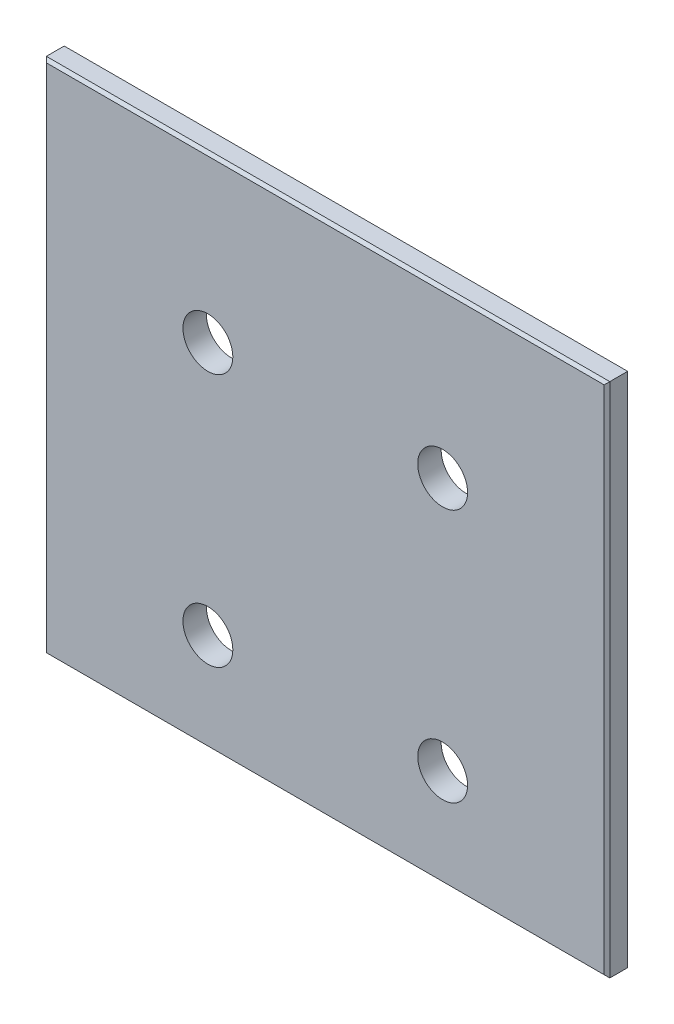
ISO-10303-21;
HEADER;
FILE_DESCRIPTION(('STEP AP214'),'2;1');
FILE_NAME('part.step','',(''),(''),'','','');
FILE_SCHEMA(('AUTOMOTIVE_DESIGN { 1 0 10303 214 1 1 1 1 }'));
ENDSEC;
DATA;
#1=APPLICATION_CONTEXT('core data for automotive mechanical design processes');
#2=APPLICATION_PROTOCOL_DEFINITION('international standard','automotive_design',2000,#1);
#3=PRODUCT_CONTEXT('',#1,'mechanical');
#4=PRODUCT('Part','Part','',(#3));
#5=PRODUCT_RELATED_PRODUCT_CATEGORY('part','',(#4));
#6=PRODUCT_DEFINITION_FORMATION('','',#4);
#7=PRODUCT_DEFINITION_CONTEXT('part definition',#1,'design');
#8=PRODUCT_DEFINITION('design','',#6,#7);
#9=PRODUCT_DEFINITION_SHAPE('','',#8);
#10=(LENGTH_UNIT() NAMED_UNIT(*) SI_UNIT(.MILLI.,.METRE.));
#11=(NAMED_UNIT(*) PLANE_ANGLE_UNIT() SI_UNIT($,.RADIAN.));
#12=(NAMED_UNIT(*) SI_UNIT($,.STERADIAN.) SOLID_ANGLE_UNIT());
#13=UNCERTAINTY_MEASURE_WITH_UNIT(LENGTH_MEASURE(1.E-05),#10,'distance_accuracy_value','');
#14=(GEOMETRIC_REPRESENTATION_CONTEXT(3) GLOBAL_UNCERTAINTY_ASSIGNED_CONTEXT((#13)) GLOBAL_UNIT_ASSIGNED_CONTEXT((#10,
#11,#12)) REPRESENTATION_CONTEXT('',''));
#15=CARTESIAN_POINT('',(0.,0.,0.));
#16=DIRECTION('',(0.,0.,1.));
#17=DIRECTION('',(1.,0.,0.));
#18=AXIS2_PLACEMENT_3D('',#15,#16,#17);
#19=CARTESIAN_POINT('',(-76.2,69.85,6.35));
#20=DIRECTION('',(1.,0.,0.));
#21=DIRECTION('',(0.,1.,0.));
#22=AXIS2_PLACEMENT_3D('',#19,#20,#21);
#23=PLANE('',#22);
#24=DIRECTION('',(0.,0.,-1.));
#25=VECTOR('',#24,1.);
#26=CARTESIAN_POINT('',(-76.2,69.85,6.35));
#27=LINE('',#26,#25);
#28=CARTESIAN_POINT('',(-76.2,69.85,5.58799999999999));
#29=VERTEX_POINT('',#28);
#30=CARTESIAN_POINT('',(-76.2,69.85,0.761999999999999));
#31=VERTEX_POINT('',#30);
#32=EDGE_CURVE('E170',#29,#31,#27,.T.);
#33=ORIENTED_EDGE('',*,*,#32,.T.);
#34=DIRECTION('',(0.,-1.,0.));
#35=VECTOR('',#34,1.);
#36=CARTESIAN_POINT('',(-76.2,69.85,0.761999999999999));
#37=LINE('',#36,#35);
#38=CARTESIAN_POINT('',(-76.2,-69.85,0.761999999999999));
#39=VERTEX_POINT('',#38);
#40=EDGE_CURVE('E195',#31,#39,#37,.T.);
#41=ORIENTED_EDGE('',*,*,#40,.T.);
#42=DIRECTION('',(0.,0.,-1.));
#43=VECTOR('',#42,1.);
#44=CARTESIAN_POINT('',(-76.2,-69.85,6.35));
#45=LINE('',#44,#43);
#46=CARTESIAN_POINT('',(-76.2,-69.85,5.58799999999999));
#47=VERTEX_POINT('',#46);
#48=EDGE_CURVE('E133',#47,#39,#45,.T.);
#49=ORIENTED_EDGE('',*,*,#48,.F.);
#50=DIRECTION('',(0.,1.,0.));
#51=VECTOR('',#50,1.);
#52=CARTESIAN_POINT('',(-76.2,69.85,5.58799999999999));
#53=LINE('',#52,#51);
#54=EDGE_CURVE('E193',#47,#29,#53,.T.);
#55=ORIENTED_EDGE('',*,*,#54,.T.);
#56=EDGE_LOOP('',(#33,#41,#49,#55));
#57=FACE_BOUND('',#56,.T.);
#58=ADVANCED_FACE('F44',(#57),#23,.F.);
#59=CARTESIAN_POINT('',(-76.2,-69.85,6.35));
#60=DIRECTION('',(0.,1.,0.));
#61=DIRECTION('',(0.,0.,1.));
#62=AXIS2_PLACEMENT_3D('',#59,#60,#61);
#63=PLANE('',#62);
#64=ORIENTED_EDGE('',*,*,#48,.T.);
#65=DIRECTION('',(1.,0.,0.));
#66=VECTOR('',#65,1.);
#67=CARTESIAN_POINT('',(-76.2,-69.85,0.761999999999999));
#68=LINE('',#67,#66);
#69=CARTESIAN_POINT('',(76.2,-69.85,0.761999999999999));
#70=VERTEX_POINT('',#69);
#71=EDGE_CURVE('E132',#39,#70,#68,.T.);
#72=ORIENTED_EDGE('',*,*,#71,.T.);
#73=DIRECTION('',(0.,0.,-1.));
#74=VECTOR('',#73,1.);
#75=CARTESIAN_POINT('',(76.2,-69.85,6.35));
#76=LINE('',#75,#74);
#77=CARTESIAN_POINT('',(76.2,-69.85,5.58799999999999));
#78=VERTEX_POINT('',#77);
#79=EDGE_CURVE('E115',#78,#70,#76,.T.);
#80=ORIENTED_EDGE('',*,*,#79,.F.);
#81=DIRECTION('',(-1.,0.,0.));
#82=VECTOR('',#81,1.);
#83=CARTESIAN_POINT('',(-76.2,-69.85,5.58799999999999));
#84=LINE('',#83,#82);
#85=EDGE_CURVE('E129',#78,#47,#84,.T.);
#86=ORIENTED_EDGE('',*,*,#85,.T.);
#87=EDGE_LOOP('',(#64,#72,#80,#86));
#88=FACE_BOUND('',#87,.T.);
#89=ADVANCED_FACE('F128',(#88),#63,.F.);
#90=CARTESIAN_POINT('',(76.2,69.85,6.35));
#91=DIRECTION('',(-1.,0.,0.));
#92=DIRECTION('',(0.,0.,1.));
#93=AXIS2_PLACEMENT_3D('',#90,#91,#92);
#94=PLANE('',#93);
#95=ORIENTED_EDGE('',*,*,#79,.T.);
#96=DIRECTION('',(0.,1.,0.));
#97=VECTOR('',#96,1.);
#98=CARTESIAN_POINT('',(76.2,69.85,0.761999999999999));
#99=LINE('',#98,#97);
#100=CARTESIAN_POINT('',(76.2,69.85,0.761999999999999));
#101=VERTEX_POINT('',#100);
#102=EDGE_CURVE('E121',#70,#101,#99,.T.);
#103=ORIENTED_EDGE('',*,*,#102,.T.);
#104=DIRECTION('',(0.,0.,-1.));
#105=VECTOR('',#104,1.);
#106=CARTESIAN_POINT('',(76.2,69.85,6.35));
#107=LINE('',#106,#105);
#108=CARTESIAN_POINT('',(76.2,69.85,5.58799999999999));
#109=VERTEX_POINT('',#108);
#110=EDGE_CURVE('E117',#109,#101,#107,.T.);
#111=ORIENTED_EDGE('',*,*,#110,.F.);
#112=DIRECTION('',(0.,-1.,0.));
#113=VECTOR('',#112,1.);
#114=CARTESIAN_POINT('',(76.2,-69.85,5.58799999999999));
#115=LINE('',#114,#113);
#116=EDGE_CURVE('E112',#109,#78,#115,.T.);
#117=ORIENTED_EDGE('',*,*,#116,.T.);
#118=EDGE_LOOP('',(#95,#103,#111,#117));
#119=FACE_BOUND('',#118,.T.);
#120=ADVANCED_FACE('F114',(#119),#94,.F.);
#121=CARTESIAN_POINT('',(-76.2,69.85,6.35));
#122=DIRECTION('',(0.,-1.,0.));
#123=DIRECTION('',(0.,0.,-1.));
#124=AXIS2_PLACEMENT_3D('',#121,#122,#123);
#125=PLANE('',#124);
#126=ORIENTED_EDGE('',*,*,#110,.T.);
#127=DIRECTION('',(-1.,0.,0.));
#128=VECTOR('',#127,1.);
#129=CARTESIAN_POINT('',(-76.2,69.85,0.761999999999999));
#130=LINE('',#129,#128);
#131=EDGE_CURVE('E122',#101,#31,#130,.T.);
#132=ORIENTED_EDGE('',*,*,#131,.T.);
#133=ORIENTED_EDGE('',*,*,#32,.F.);
#134=DIRECTION('',(1.,0.,0.));
#135=VECTOR('',#134,1.);
#136=CARTESIAN_POINT('',(76.2,69.85,5.58799999999999));
#137=LINE('',#136,#135);
#138=EDGE_CURVE('E197',#29,#109,#137,.T.);
#139=ORIENTED_EDGE('',*,*,#138,.T.);
#140=EDGE_LOOP('',(#126,#132,#133,#139));
#141=FACE_BOUND('',#140,.T.);
#142=ADVANCED_FACE('F209',(#141),#125,.F.);
#143=CARTESIAN_POINT('',(-76.2,-69.85,6.35));
#144=DIRECTION('',(0.,0.,1.));
#145=DIRECTION('',(1.,0.,0.));
#146=AXIS2_PLACEMENT_3D('',#143,#144,#145);
#147=PLANE('',#146);
#148=CARTESIAN_POINT('',(-31.75,25.4,6.35));
#149=DIRECTION('',(0.,0.,1.));
#150=DIRECTION('',(1.,0.,0.));
#151=AXIS2_PLACEMENT_3D('',#148,#149,#150);
#152=CIRCLE('',#151,6.74623999999999);
#153=CARTESIAN_POINT('',(-25.00376,25.4,6.35));
#154=VERTEX_POINT('',#153);
#155=EDGE_CURVE('E266',#154,#154,#152,.T.);
#156=ORIENTED_EDGE('',*,*,#155,.F.);
#157=EDGE_LOOP('',(#156));
#158=FACE_BOUND('',#157,.T.);
#159=CARTESIAN_POINT('',(31.75,25.4,6.35));
#160=DIRECTION('',(0.,0.,1.));
#161=DIRECTION('',(1.,0.,0.));
#162=AXIS2_PLACEMENT_3D('',#159,#160,#161);
#163=CIRCLE('',#162,6.74623999999999);
#164=CARTESIAN_POINT('',(38.49624,25.4,6.35));
#165=VERTEX_POINT('',#164);
#166=EDGE_CURVE('E268',#165,#165,#163,.T.);
#167=ORIENTED_EDGE('',*,*,#166,.F.);
#168=EDGE_LOOP('',(#167));
#169=FACE_BOUND('',#168,.T.);
#170=CARTESIAN_POINT('',(-31.75,-43.18,6.35));
#171=DIRECTION('',(0.,0.,1.));
#172=DIRECTION('',(1.,0.,0.));
#173=AXIS2_PLACEMENT_3D('',#170,#171,#172);
#174=CIRCLE('',#173,6.74623999999999);
#175=CARTESIAN_POINT('',(-25.00376,-43.18,6.35));
#176=VERTEX_POINT('',#175);
#177=EDGE_CURVE('E276',#176,#176,#174,.T.);
#178=ORIENTED_EDGE('',*,*,#177,.F.);
#179=EDGE_LOOP('',(#178));
#180=FACE_BOUND('',#179,.T.);
#181=CARTESIAN_POINT('',(31.75,-43.18,6.35));
#182=DIRECTION('',(0.,0.,1.));
#183=DIRECTION('',(1.,0.,0.));
#184=AXIS2_PLACEMENT_3D('',#181,#182,#183);
#185=CIRCLE('',#184,6.74623999999999);
#186=CARTESIAN_POINT('',(38.49624,-43.18,6.35));
#187=VERTEX_POINT('',#186);
#188=EDGE_CURVE('E146',#187,#187,#185,.T.);
#189=ORIENTED_EDGE('',*,*,#188,.F.);
#190=EDGE_LOOP('',(#189));
#191=FACE_BOUND('',#190,.T.);
#192=DIRECTION('',(0.,-1.,0.));
#193=VECTOR('',#192,1.);
#194=CARTESIAN_POINT('',(-75.438,-69.85,6.35));
#195=LINE('',#194,#193);
#196=CARTESIAN_POINT('',(-75.438,69.088,6.35));
#197=VERTEX_POINT('',#196);
#198=CARTESIAN_POINT('',(-75.438,-69.088,6.35));
#199=VERTEX_POINT('',#198);
#200=EDGE_CURVE('E201',#197,#199,#195,.T.);
#201=ORIENTED_EDGE('',*,*,#200,.T.);
#202=DIRECTION('',(1.,0.,0.));
#203=VECTOR('',#202,1.);
#204=CARTESIAN_POINT('',(76.2,-69.088,6.35));
#205=LINE('',#204,#203);
#206=CARTESIAN_POINT('',(75.438,-69.088,6.35));
#207=VERTEX_POINT('',#206);
#208=EDGE_CURVE('E13',#199,#207,#205,.T.);
#209=ORIENTED_EDGE('',*,*,#208,.T.);
#210=DIRECTION('',(0.,1.,0.));
#211=VECTOR('',#210,1.);
#212=CARTESIAN_POINT('',(75.438,69.85,6.35));
#213=LINE('',#212,#211);
#214=CARTESIAN_POINT('',(75.438,69.088,6.35));
#215=VERTEX_POINT('',#214);
#216=EDGE_CURVE('E53',#207,#215,#213,.T.);
#217=ORIENTED_EDGE('',*,*,#216,.T.);
#218=DIRECTION('',(-1.,0.,0.));
#219=VECTOR('',#218,1.);
#220=CARTESIAN_POINT('',(-76.2,69.088,6.35));
#221=LINE('',#220,#219);
#222=EDGE_CURVE('E203',#215,#197,#221,.T.);
#223=ORIENTED_EDGE('',*,*,#222,.T.);
#224=EDGE_LOOP('',(#201,#209,#217,#223));
#225=FACE_BOUND('',#224,.T.);
#226=ADVANCED_FACE('F204',(#158,#169,#180,#191,#225),#147,.T.);
#227=CARTESIAN_POINT('',(-76.2,-69.85,0.));
#228=DIRECTION('',(0.,0.,1.));
#229=DIRECTION('',(1.,0.,0.));
#230=AXIS2_PLACEMENT_3D('',#227,#228,#229);
#231=PLANE('',#230);
#232=CARTESIAN_POINT('',(-31.75,25.4,0.));
#233=DIRECTION('',(0.,0.,1.));
#234=DIRECTION('',(1.,0.,0.));
#235=AXIS2_PLACEMENT_3D('',#232,#233,#234);
#236=CIRCLE('',#235,6.74623999999999);
#237=CARTESIAN_POINT('',(-25.00376,25.4,0.));
#238=VERTEX_POINT('',#237);
#239=EDGE_CURVE('E263',#238,#238,#236,.T.);
#240=ORIENTED_EDGE('',*,*,#239,.T.);
#241=EDGE_LOOP('',(#240));
#242=FACE_BOUND('',#241,.T.);
#243=CARTESIAN_POINT('',(31.75,25.4,0.));
#244=DIRECTION('',(0.,0.,1.));
#245=DIRECTION('',(1.,0.,0.));
#246=AXIS2_PLACEMENT_3D('',#243,#244,#245);
#247=CIRCLE('',#246,6.74623999999999);
#248=CARTESIAN_POINT('',(38.49624,25.4,0.));
#249=VERTEX_POINT('',#248);
#250=EDGE_CURVE('E273',#249,#249,#247,.T.);
#251=ORIENTED_EDGE('',*,*,#250,.T.);
#252=EDGE_LOOP('',(#251));
#253=FACE_BOUND('',#252,.T.);
#254=CARTESIAN_POINT('',(-31.75,-43.18,0.));
#255=DIRECTION('',(0.,0.,1.));
#256=DIRECTION('',(1.,0.,0.));
#257=AXIS2_PLACEMENT_3D('',#254,#255,#256);
#258=CIRCLE('',#257,6.74623999999999);
#259=CARTESIAN_POINT('',(-25.00376,-43.18,0.));
#260=VERTEX_POINT('',#259);
#261=EDGE_CURVE('E279',#260,#260,#258,.T.);
#262=ORIENTED_EDGE('',*,*,#261,.T.);
#263=EDGE_LOOP('',(#262));
#264=FACE_BOUND('',#263,.T.);
#265=CARTESIAN_POINT('',(31.75,-43.18,0.));
#266=DIRECTION('',(0.,0.,1.));
#267=DIRECTION('',(1.,0.,0.));
#268=AXIS2_PLACEMENT_3D('',#265,#266,#267);
#269=CIRCLE('',#268,6.74623999999999);
#270=CARTESIAN_POINT('',(38.49624,-43.18,0.));
#271=VERTEX_POINT('',#270);
#272=EDGE_CURVE('E141',#271,#271,#269,.T.);
#273=ORIENTED_EDGE('',*,*,#272,.T.);
#274=EDGE_LOOP('',(#273));
#275=FACE_BOUND('',#274,.T.);
#276=DIRECTION('',(0.,-1.,0.));
#277=VECTOR('',#276,1.);
#278=CARTESIAN_POINT('',(75.438,-69.85,0.));
#279=LINE('',#278,#277);
#280=CARTESIAN_POINT('',(75.438,69.088,0.));
#281=VERTEX_POINT('',#280);
#282=CARTESIAN_POINT('',(75.438,-69.088,0.));
#283=VERTEX_POINT('',#282);
#284=EDGE_CURVE('E184',#281,#283,#279,.T.);
#285=ORIENTED_EDGE('',*,*,#284,.T.);
#286=DIRECTION('',(-1.,0.,0.));
#287=VECTOR('',#286,1.);
#288=CARTESIAN_POINT('',(-76.2,-69.088,0.));
#289=LINE('',#288,#287);
#290=CARTESIAN_POINT('',(-75.438,-69.088,0.));
#291=VERTEX_POINT('',#290);
#292=EDGE_CURVE('E190',#283,#291,#289,.T.);
#293=ORIENTED_EDGE('',*,*,#292,.T.);
#294=DIRECTION('',(0.,1.,0.));
#295=VECTOR('',#294,1.);
#296=CARTESIAN_POINT('',(-75.438,-69.85,0.));
#297=LINE('',#296,#295);
#298=CARTESIAN_POINT('',(-75.438,69.088,0.));
#299=VERTEX_POINT('',#298);
#300=EDGE_CURVE('E188',#291,#299,#297,.T.);
#301=ORIENTED_EDGE('',*,*,#300,.T.);
#302=DIRECTION('',(1.,0.,0.));
#303=VECTOR('',#302,1.);
#304=CARTESIAN_POINT('',(-76.2,69.088,0.));
#305=LINE('',#304,#303);
#306=EDGE_CURVE('E186',#299,#281,#305,.T.);
#307=ORIENTED_EDGE('',*,*,#306,.T.);
#308=EDGE_LOOP('',(#285,#293,#301,#307));
#309=FACE_BOUND('',#308,.T.);
#310=ADVANCED_FACE('F236',(#242,#253,#264,#275,#309),#231,.F.);
#311=CARTESIAN_POINT('',(-76.2,69.85,0.761999999999999));
#312=DIRECTION('',(0.,-0.707106781186554,0.707106781186541));
#313=DIRECTION('',(0.,-0.707106781186541,-0.707106781186554));
#314=AXIS2_PLACEMENT_3D('',#311,#312,#313);
#315=PLANE('',#314);
#316=DIRECTION('',(0.577350269189636,0.577350269189615,0.577350269189626));
#317=VECTOR('',#316,1.);
#318=CARTESIAN_POINT('',(76.2,69.85,0.761999999999999));
#319=LINE('',#318,#317);
#320=EDGE_CURVE('E162',#281,#101,#319,.T.);
#321=ORIENTED_EDGE('',*,*,#320,.F.);
#322=ORIENTED_EDGE('',*,*,#306,.F.);
#323=DIRECTION('',(-0.577350269189629,0.577350269189619,0.577350269189629));
#324=VECTOR('',#323,1.);
#325=CARTESIAN_POINT('',(-76.2,69.85,0.761999999999999));
#326=LINE('',#325,#324);
#327=EDGE_CURVE('E149',#31,#299,#326,.F.);
#328=ORIENTED_EDGE('',*,*,#327,.F.);
#329=ORIENTED_EDGE('',*,*,#131,.F.);
#330=EDGE_LOOP('',(#321,#322,#328,#329));
#331=FACE_BOUND('',#330,.T.);
#332=ADVANCED_FACE('F212',(#331),#315,.F.);
#333=CARTESIAN_POINT('',(-76.2,69.85,0.761999999999999));
#334=DIRECTION('',(0.707106781186548,0.,0.707106781186548));
#335=DIRECTION('',(0.707106781186548,0.,-0.707106781186548));
#336=AXIS2_PLACEMENT_3D('',#333,#334,#335);
#337=PLANE('',#336);
#338=ORIENTED_EDGE('',*,*,#327,.T.);
#339=ORIENTED_EDGE('',*,*,#300,.F.);
#340=DIRECTION('',(-0.577350269189626,-0.577350269189626,0.577350269189626));
#341=VECTOR('',#340,1.);
#342=CARTESIAN_POINT('',(-29.6333333333333,-23.2833333333333,-45.8046666666667));
#343=LINE('',#342,#341);
#344=EDGE_CURVE('E156',#39,#291,#343,.F.);
#345=ORIENTED_EDGE('',*,*,#344,.F.);
#346=ORIENTED_EDGE('',*,*,#40,.F.);
#347=EDGE_LOOP('',(#338,#339,#345,#346));
#348=FACE_BOUND('',#347,.T.);
#349=ADVANCED_FACE('F215',(#348),#337,.F.);
#350=CARTESIAN_POINT('',(76.2,69.85,0.761999999999999));
#351=DIRECTION('',(-0.707106781186541,0.,0.707106781186554));
#352=DIRECTION('',(0.707106781186554,0.,0.707106781186541));
#353=AXIS2_PLACEMENT_3D('',#350,#351,#352);
#354=PLANE('',#353);
#355=ORIENTED_EDGE('',*,*,#320,.T.);
#356=ORIENTED_EDGE('',*,*,#102,.F.);
#357=DIRECTION('',(-0.577350269189633,0.577350269189622,-0.577350269189622));
#358=VECTOR('',#357,1.);
#359=CARTESIAN_POINT('',(29.6333333333331,-23.2833333333339,-45.8046666666661));
#360=LINE('',#359,#358);
#361=EDGE_CURVE('E152',#283,#70,#360,.F.);
#362=ORIENTED_EDGE('',*,*,#361,.F.);
#363=ORIENTED_EDGE('',*,*,#284,.F.);
#364=EDGE_LOOP('',(#355,#356,#362,#363));
#365=FACE_BOUND('',#364,.T.);
#366=ADVANCED_FACE('F218',(#365),#354,.F.);
#367=CARTESIAN_POINT('',(-76.2,-69.85,0.761999999999999));
#368=DIRECTION('',(0.,0.707106781186548,0.707106781186548));
#369=DIRECTION('',(0.,-0.707106781186548,0.707106781186548));
#370=AXIS2_PLACEMENT_3D('',#367,#368,#369);
#371=PLANE('',#370);
#372=ORIENTED_EDGE('',*,*,#344,.T.);
#373=ORIENTED_EDGE('',*,*,#292,.F.);
#374=ORIENTED_EDGE('',*,*,#361,.T.);
#375=ORIENTED_EDGE('',*,*,#71,.F.);
#376=EDGE_LOOP('',(#372,#373,#374,#375));
#377=FACE_BOUND('',#376,.T.);
#378=ADVANCED_FACE('F216',(#377),#371,.F.);
#379=CARTESIAN_POINT('',(-76.2,69.088,6.35));
#380=DIRECTION('',(0.,0.707106781186558,0.707106781186537));
#381=DIRECTION('',(0.,-0.707106781186537,0.707106781186558));
#382=AXIS2_PLACEMENT_3D('',#379,#380,#381);
#383=PLANE('',#382);
#384=DIRECTION('',(0.577350269189634,0.577350269189613,-0.57735026918963));
#385=VECTOR('',#384,1.);
#386=CARTESIAN_POINT('',(24.8919999999985,18.5420000000003,56.8960000000011));
#387=LINE('',#386,#385);
#388=EDGE_CURVE('E143',#109,#215,#387,.F.);
#389=ORIENTED_EDGE('',*,*,#388,.F.);
#390=ORIENTED_EDGE('',*,*,#138,.F.);
#391=DIRECTION('',(-0.577350269189627,0.577350269189617,-0.577350269189633));
#392=VECTOR('',#391,1.);
#393=CARTESIAN_POINT('',(-29.1253333333339,22.7753333333348,52.6626666666666));
#394=LINE('',#393,#392);
#395=EDGE_CURVE('E48',#197,#29,#394,.T.);
#396=ORIENTED_EDGE('',*,*,#395,.F.);
#397=ORIENTED_EDGE('',*,*,#222,.F.);
#398=EDGE_LOOP('',(#389,#390,#396,#397));
#399=FACE_BOUND('',#398,.T.);
#400=ADVANCED_FACE('F46',(#399),#383,.T.);
#401=CARTESIAN_POINT('',(-75.438,-69.85,6.35));
#402=DIRECTION('',(-0.707106781186551,0.,0.707106781186544));
#403=DIRECTION('',(0.707106781186544,0.,0.707106781186551));
#404=AXIS2_PLACEMENT_3D('',#401,#402,#403);
#405=PLANE('',#404);
#406=ORIENTED_EDGE('',*,*,#395,.T.);
#407=ORIENTED_EDGE('',*,*,#54,.F.);
#408=DIRECTION('',(0.577350269189624,0.577350269189624,0.57735026918963));
#409=VECTOR('',#408,1.);
#410=CARTESIAN_POINT('',(-75.692,-69.342,6.096));
#411=LINE('',#410,#409);
#412=EDGE_CURVE('E137',#199,#47,#411,.F.);
#413=ORIENTED_EDGE('',*,*,#412,.F.);
#414=ORIENTED_EDGE('',*,*,#200,.F.);
#415=EDGE_LOOP('',(#406,#407,#413,#414));
#416=FACE_BOUND('',#415,.T.);
#417=ADVANCED_FACE('F207',(#416),#405,.T.);
#418=CARTESIAN_POINT('',(75.438,-69.85,6.35));
#419=DIRECTION('',(0.707106781186545,0.,0.70710678118655));
#420=DIRECTION('',(0.70710678118655,0.,-0.707106781186545));
#421=AXIS2_PLACEMENT_3D('',#418,#419,#420);
#422=PLANE('',#421);
#423=ORIENTED_EDGE('',*,*,#388,.T.);
#424=ORIENTED_EDGE('',*,*,#216,.F.);
#425=DIRECTION('',(0.577350269189631,-0.57735026918962,-0.577350269189626));
#426=VECTOR('',#425,1.);
#427=CARTESIAN_POINT('',(75.692,-69.342,6.096));
#428=LINE('',#427,#426);
#429=EDGE_CURVE('E61',#78,#207,#428,.F.);
#430=ORIENTED_EDGE('',*,*,#429,.F.);
#431=ORIENTED_EDGE('',*,*,#116,.F.);
#432=EDGE_LOOP('',(#423,#424,#430,#431));
#433=FACE_BOUND('',#432,.T.);
#434=ADVANCED_FACE('F140',(#433),#422,.T.);
#435=CARTESIAN_POINT('',(-76.2,-69.088,6.35));
#436=DIRECTION('',(0.,-0.707106781186551,0.707106781186544));
#437=DIRECTION('',(0.,-0.707106781186544,-0.707106781186551));
#438=AXIS2_PLACEMENT_3D('',#435,#436,#437);
#439=PLANE('',#438);
#440=ORIENTED_EDGE('',*,*,#412,.T.);
#441=ORIENTED_EDGE('',*,*,#85,.F.);
#442=ORIENTED_EDGE('',*,*,#429,.T.);
#443=ORIENTED_EDGE('',*,*,#208,.F.);
#444=EDGE_LOOP('',(#440,#441,#442,#443));
#445=FACE_BOUND('',#444,.T.);
#446=ADVANCED_FACE('F135',(#445),#439,.T.);
#447=CARTESIAN_POINT('',(31.75,-43.18,6.35));
#448=DIRECTION('',(0.,0.,1.));
#449=DIRECTION('',(1.,0.,0.));
#450=AXIS2_PLACEMENT_3D('',#447,#448,#449);
#451=CYLINDRICAL_SURFACE('',#450,6.74623999999999);
#452=ORIENTED_EDGE('',*,*,#272,.F.);
#453=EDGE_LOOP('',(#452));
#454=FACE_BOUND('',#453,.T.);
#455=ORIENTED_EDGE('',*,*,#188,.T.);
#456=EDGE_LOOP('',(#455));
#457=FACE_BOUND('',#456,.T.);
#458=ADVANCED_FACE('F243',(#454,#457),#451,.F.);
#459=CARTESIAN_POINT('',(-31.75,-43.18,6.35));
#460=DIRECTION('',(0.,0.,1.));
#461=DIRECTION('',(1.,0.,0.));
#462=AXIS2_PLACEMENT_3D('',#459,#460,#461);
#463=CYLINDRICAL_SURFACE('',#462,6.74623999999999);
#464=ORIENTED_EDGE('',*,*,#261,.F.);
#465=EDGE_LOOP('',(#464));
#466=FACE_BOUND('',#465,.T.);
#467=ORIENTED_EDGE('',*,*,#177,.T.);
#468=EDGE_LOOP('',(#467));
#469=FACE_BOUND('',#468,.T.);
#470=ADVANCED_FACE('F246',(#466,#469),#463,.F.);
#471=CARTESIAN_POINT('',(31.75,25.4,6.35));
#472=DIRECTION('',(0.,0.,1.));
#473=DIRECTION('',(1.,0.,0.));
#474=AXIS2_PLACEMENT_3D('',#471,#472,#473);
#475=CYLINDRICAL_SURFACE('',#474,6.74623999999999);
#476=ORIENTED_EDGE('',*,*,#250,.F.);
#477=EDGE_LOOP('',(#476));
#478=FACE_BOUND('',#477,.T.);
#479=ORIENTED_EDGE('',*,*,#166,.T.);
#480=EDGE_LOOP('',(#479));
#481=FACE_BOUND('',#480,.T.);
#482=ADVANCED_FACE('F250',(#478,#481),#475,.F.);
#483=CARTESIAN_POINT('',(-31.75,25.4,6.35));
#484=DIRECTION('',(0.,0.,1.));
#485=DIRECTION('',(1.,0.,0.));
#486=AXIS2_PLACEMENT_3D('',#483,#484,#485);
#487=CYLINDRICAL_SURFACE('',#486,6.74623999999999);
#488=ORIENTED_EDGE('',*,*,#239,.F.);
#489=EDGE_LOOP('',(#488));
#490=FACE_BOUND('',#489,.T.);
#491=ORIENTED_EDGE('',*,*,#155,.T.);
#492=EDGE_LOOP('',(#491));
#493=FACE_BOUND('',#492,.T.);
#494=ADVANCED_FACE('F254',(#490,#493),#487,.F.);
#495=CLOSED_SHELL('',(#58,#89,#120,#142,#226,#310,#332,#349,#366,#378,#400,#417,#434,#446,#458,
#470,#482,#494));
#496=MANIFOLD_SOLID_BREP('B2',#495);
#497=ADVANCED_BREP_SHAPE_REPRESENTATION('',(#18,#496),#14);
#498=SHAPE_DEFINITION_REPRESENTATION(#9,#497);
ENDSEC;
END-ISO-10303-21;
